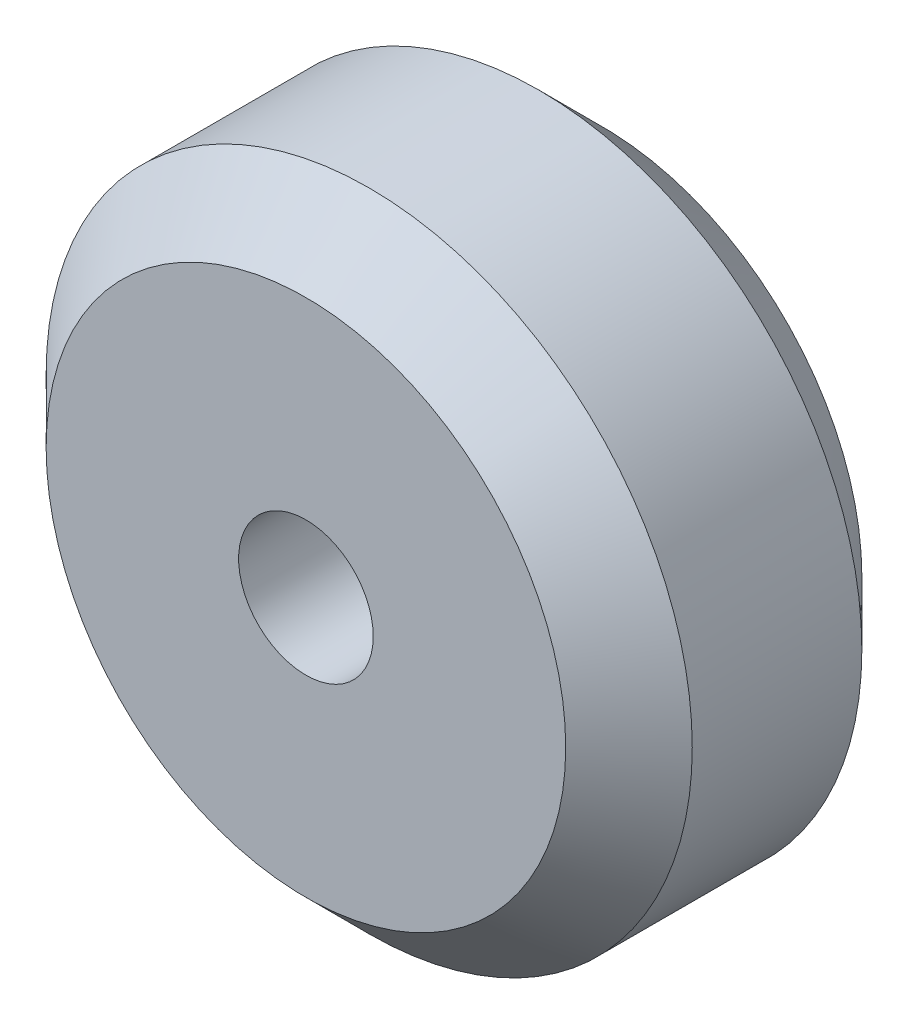
ISO-10303-21;
HEADER;
FILE_DESCRIPTION(('STEP AP214'),'2;1');
FILE_NAME('part.step','',(''),(''),'','','');
FILE_SCHEMA(('AUTOMOTIVE_DESIGN { 1 0 10303 214 1 1 1 1 }'));
ENDSEC;
DATA;
#1=APPLICATION_CONTEXT('core data for automotive mechanical design processes');
#2=APPLICATION_PROTOCOL_DEFINITION('international standard','automotive_design',2000,#1);
#3=PRODUCT_CONTEXT('',#1,'mechanical');
#4=PRODUCT('Part','Part','',(#3));
#5=PRODUCT_RELATED_PRODUCT_CATEGORY('part','',(#4));
#6=PRODUCT_DEFINITION_FORMATION('','',#4);
#7=PRODUCT_DEFINITION_CONTEXT('part definition',#1,'design');
#8=PRODUCT_DEFINITION('design','',#6,#7);
#9=PRODUCT_DEFINITION_SHAPE('','',#8);
#10=(LENGTH_UNIT() NAMED_UNIT(*) SI_UNIT(.MILLI.,.METRE.));
#11=(NAMED_UNIT(*) PLANE_ANGLE_UNIT() SI_UNIT($,.RADIAN.));
#12=(NAMED_UNIT(*) SI_UNIT($,.STERADIAN.) SOLID_ANGLE_UNIT());
#13=UNCERTAINTY_MEASURE_WITH_UNIT(LENGTH_MEASURE(1.E-05),#10,'distance_accuracy_value','');
#14=(GEOMETRIC_REPRESENTATION_CONTEXT(3) GLOBAL_UNCERTAINTY_ASSIGNED_CONTEXT((#13)) GLOBAL_UNIT_ASSIGNED_CONTEXT((#10,
#11,#12)) REPRESENTATION_CONTEXT('',''));
#15=CARTESIAN_POINT('',(0.,0.,0.));
#16=DIRECTION('',(0.,0.,1.));
#17=DIRECTION('',(1.,0.,0.));
#18=AXIS2_PLACEMENT_3D('',#15,#16,#17);
#19=CARTESIAN_POINT('',(0.,0.,0.));
#20=DIRECTION('',(0.,0.,1.));
#21=DIRECTION('',(1.,0.,0.));
#22=AXIS2_PLACEMENT_3D('',#19,#20,#21);
#23=CYLINDRICAL_SURFACE('',#22,2.5);
#24=CARTESIAN_POINT('',(0.,0.,0.));
#25=DIRECTION('',(0.,0.,1.));
#26=DIRECTION('',(1.,0.,0.));
#27=AXIS2_PLACEMENT_3D('',#24,#25,#26);
#28=CIRCLE('',#27,2.5);
#29=CARTESIAN_POINT('',(2.5,0.,0.));
#30=VERTEX_POINT('',#29);
#31=EDGE_CURVE('E10',#30,#30,#28,.T.);
#32=ORIENTED_EDGE('',*,*,#31,.T.);
#33=EDGE_LOOP('',(#32));
#34=FACE_BOUND('',#33,.T.);
#35=CARTESIAN_POINT('',(0.,0.,-11.));
#36=DIRECTION('',(0.,0.,1.));
#37=DIRECTION('',(1.,0.,0.));
#38=AXIS2_PLACEMENT_3D('',#35,#36,#37);
#39=CIRCLE('',#38,2.5);
#40=CARTESIAN_POINT('',(2.5,0.,-11.));
#41=VERTEX_POINT('',#40);
#42=EDGE_CURVE('E57',#41,#41,#39,.T.);
#43=ORIENTED_EDGE('',*,*,#42,.F.);
#44=EDGE_LOOP('',(#43));
#45=FACE_BOUND('',#44,.T.);
#46=ADVANCED_FACE('F35',(#34,#45),#23,.F.);
#47=CARTESIAN_POINT('',(2.5,0.,0.));
#48=DIRECTION('',(0.,0.,1.));
#49=DIRECTION('',(1.,0.,0.));
#50=AXIS2_PLACEMENT_3D('',#47,#48,#49);
#51=PLANE('',#50);
#52=CARTESIAN_POINT('',(0.,0.,0.));
#53=DIRECTION('',(0.,0.,1.));
#54=DIRECTION('',(1.,0.,0.));
#55=AXIS2_PLACEMENT_3D('',#52,#53,#54);
#56=CIRCLE('',#55,9.65000000000001);
#57=CARTESIAN_POINT('',(9.65000000000001,0.,0.));
#58=VERTEX_POINT('',#57);
#59=EDGE_CURVE('E41',#58,#58,#56,.T.);
#60=ORIENTED_EDGE('',*,*,#59,.T.);
#61=EDGE_LOOP('',(#60));
#62=FACE_BOUND('',#61,.T.);
#63=ORIENTED_EDGE('',*,*,#31,.F.);
#64=EDGE_LOOP('',(#63));
#65=FACE_BOUND('',#64,.T.);
#66=ADVANCED_FACE('F65',(#62,#65),#51,.T.);
#67=CARTESIAN_POINT('',(0.,0.,0.));
#68=DIRECTION('',(0.,0.,-1.));
#69=DIRECTION('',(-1.,0.,0.));
#70=AXIS2_PLACEMENT_3D('',#67,#68,#69);
#71=CONICAL_SURFACE('',#70,9.65000000000001,0.785398163397447);
#72=CARTESIAN_POINT('',(0.,0.,-2.35));
#73=DIRECTION('',(0.,0.,1.));
#74=DIRECTION('',(1.,0.,0.));
#75=AXIS2_PLACEMENT_3D('',#72,#73,#74);
#76=CIRCLE('',#75,12.);
#77=CARTESIAN_POINT('',(12.,0.,-2.35));
#78=VERTEX_POINT('',#77);
#79=EDGE_CURVE('E45',#78,#78,#76,.T.);
#80=ORIENTED_EDGE('',*,*,#79,.T.);
#81=EDGE_LOOP('',(#80));
#82=FACE_BOUND('',#81,.T.);
#83=ORIENTED_EDGE('',*,*,#59,.F.);
#84=EDGE_LOOP('',(#83));
#85=FACE_BOUND('',#84,.T.);
#86=ADVANCED_FACE('F69',(#82,#85),#71,.T.);
#87=CARTESIAN_POINT('',(0.,0.,0.));
#88=DIRECTION('',(0.,0.,1.));
#89=DIRECTION('',(1.,0.,0.));
#90=AXIS2_PLACEMENT_3D('',#87,#88,#89);
#91=CYLINDRICAL_SURFACE('',#90,12.);
#92=CARTESIAN_POINT('',(0.,0.,-8.65));
#93=DIRECTION('',(0.,0.,1.));
#94=DIRECTION('',(1.,0.,0.));
#95=AXIS2_PLACEMENT_3D('',#92,#93,#94);
#96=CIRCLE('',#95,12.);
#97=CARTESIAN_POINT('',(12.,0.,-8.65));
#98=VERTEX_POINT('',#97);
#99=EDGE_CURVE('E49',#98,#98,#96,.T.);
#100=ORIENTED_EDGE('',*,*,#99,.T.);
#101=EDGE_LOOP('',(#100));
#102=FACE_BOUND('',#101,.T.);
#103=ORIENTED_EDGE('',*,*,#79,.F.);
#104=EDGE_LOOP('',(#103));
#105=FACE_BOUND('',#104,.T.);
#106=ADVANCED_FACE('F73',(#102,#105),#91,.T.);
#107=CARTESIAN_POINT('',(0.,0.,-8.65));
#108=DIRECTION('',(0.,0.,1.));
#109=DIRECTION('',(1.,0.,0.));
#110=AXIS2_PLACEMENT_3D('',#107,#108,#109);
#111=CONICAL_SURFACE('',#110,12.,0.785398163397446);
#112=CARTESIAN_POINT('',(0.,0.,-11.));
#113=DIRECTION('',(0.,0.,1.));
#114=DIRECTION('',(1.,0.,0.));
#115=AXIS2_PLACEMENT_3D('',#112,#113,#114);
#116=CIRCLE('',#115,9.65000000000001);
#117=CARTESIAN_POINT('',(9.65000000000001,0.,-11.));
#118=VERTEX_POINT('',#117);
#119=EDGE_CURVE('E54',#118,#118,#116,.T.);
#120=ORIENTED_EDGE('',*,*,#119,.T.);
#121=EDGE_LOOP('',(#120));
#122=FACE_BOUND('',#121,.T.);
#123=ORIENTED_EDGE('',*,*,#99,.F.);
#124=EDGE_LOOP('',(#123));
#125=FACE_BOUND('',#124,.T.);
#126=ADVANCED_FACE('F80',(#122,#125),#111,.T.);
#127=CARTESIAN_POINT('',(9.65000000000001,0.,-11.));
#128=DIRECTION('',(0.,0.,-1.));
#129=DIRECTION('',(-1.,0.,0.));
#130=AXIS2_PLACEMENT_3D('',#127,#128,#129);
#131=PLANE('',#130);
#132=ORIENTED_EDGE('',*,*,#42,.T.);
#133=EDGE_LOOP('',(#132));
#134=FACE_BOUND('',#133,.T.);
#135=ORIENTED_EDGE('',*,*,#119,.F.);
#136=EDGE_LOOP('',(#135));
#137=FACE_BOUND('',#136,.T.);
#138=ADVANCED_FACE('F61',(#134,#137),#131,.T.);
#139=CLOSED_SHELL('',(#46,#66,#86,#106,#126,#138));
#140=MANIFOLD_SOLID_BREP('B2',#139);
#141=ADVANCED_BREP_SHAPE_REPRESENTATION('',(#18,#140),#14);
#142=SHAPE_DEFINITION_REPRESENTATION(#9,#141);
ENDSEC;
END-ISO-10303-21;
